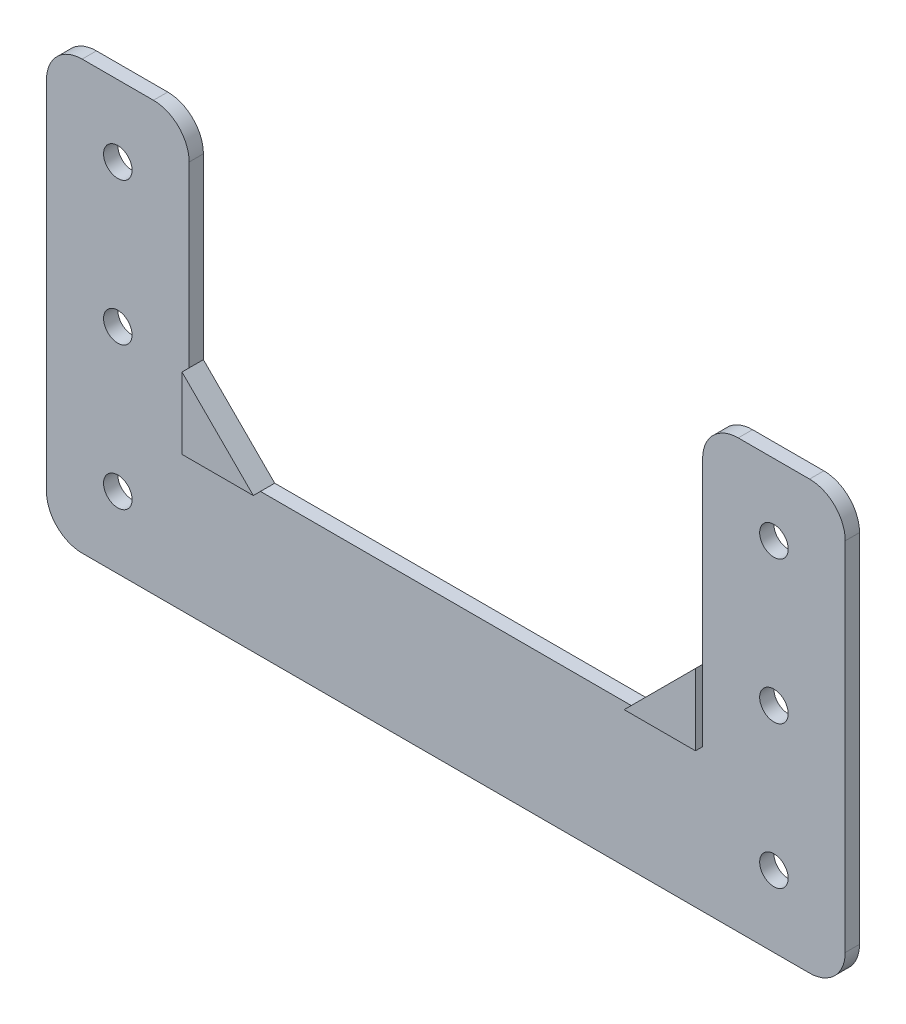
ISO-10303-21;
HEADER;
FILE_DESCRIPTION(('STEP AP214'),'2;1');
FILE_NAME('part.step','',(''),(''),'','','');
FILE_SCHEMA(('AUTOMOTIVE_DESIGN { 1 0 10303 214 1 1 1 1 }'));
ENDSEC;
DATA;
#1=APPLICATION_CONTEXT('core data for automotive mechanical design processes');
#2=APPLICATION_PROTOCOL_DEFINITION('international standard','automotive_design',2000,#1);
#3=PRODUCT_CONTEXT('',#1,'mechanical');
#4=PRODUCT('Part','Part','',(#3));
#5=PRODUCT_RELATED_PRODUCT_CATEGORY('part','',(#4));
#6=PRODUCT_DEFINITION_FORMATION('','',#4);
#7=PRODUCT_DEFINITION_CONTEXT('part definition',#1,'design');
#8=PRODUCT_DEFINITION('design','',#6,#7);
#9=PRODUCT_DEFINITION_SHAPE('','',#8);
#10=(LENGTH_UNIT() NAMED_UNIT(*) SI_UNIT(.MILLI.,.METRE.));
#11=(NAMED_UNIT(*) PLANE_ANGLE_UNIT() SI_UNIT($,.RADIAN.));
#12=(NAMED_UNIT(*) SI_UNIT($,.STERADIAN.) SOLID_ANGLE_UNIT());
#13=UNCERTAINTY_MEASURE_WITH_UNIT(LENGTH_MEASURE(1.E-05),#10,'distance_accuracy_value','');
#14=(GEOMETRIC_REPRESENTATION_CONTEXT(3) GLOBAL_UNCERTAINTY_ASSIGNED_CONTEXT((#13)) GLOBAL_UNIT_ASSIGNED_CONTEXT((#10,
#11,#12)) REPRESENTATION_CONTEXT('',''));
#15=CARTESIAN_POINT('',(0.,0.,0.));
#16=DIRECTION('',(0.,0.,1.));
#17=DIRECTION('',(1.,0.,0.));
#18=AXIS2_PLACEMENT_3D('',#15,#16,#17);
#19=CARTESIAN_POINT('',(0.,-9.99999999999999,3.));
#20=DIRECTION('',(0.,1.,0.));
#21=DIRECTION('',(-1.,0.,0.));
#22=AXIS2_PLACEMENT_3D('',#19,#20,#21);
#23=PLANE('',#22);
#24=DIRECTION('',(0.,0.,1.));
#25=VECTOR('',#24,1.);
#26=CARTESIAN_POINT('',(-26.,-10.,3.));
#27=LINE('',#26,#25);
#28=CARTESIAN_POINT('',(-26.,-10.,0.));
#29=VERTEX_POINT('',#28);
#30=CARTESIAN_POINT('',(-26.,-10.,2.));
#31=VERTEX_POINT('',#30);
#32=EDGE_CURVE('E236',#29,#31,#27,.T.);
#33=ORIENTED_EDGE('',*,*,#32,.T.);
#34=DIRECTION('',(-1.,0.,0.));
#35=VECTOR('',#34,1.);
#36=CARTESIAN_POINT('',(25.9999999999999,-9.99999999999999,2.));
#37=LINE('',#36,#35);
#38=CARTESIAN_POINT('',(25.9999999999999,-9.99999999999999,2.));
#39=VERTEX_POINT('',#38);
#40=EDGE_CURVE('E59',#39,#31,#37,.T.);
#41=ORIENTED_EDGE('',*,*,#40,.F.);
#42=DIRECTION('',(0.,0.,-1.));
#43=VECTOR('',#42,1.);
#44=CARTESIAN_POINT('',(25.9999999999999,-9.99999999999999,3.));
#45=LINE('',#44,#43);
#46=CARTESIAN_POINT('',(25.9999999999999,-9.99999999999999,0.));
#47=VERTEX_POINT('',#46);
#48=EDGE_CURVE('E239',#39,#47,#45,.T.);
#49=ORIENTED_EDGE('',*,*,#48,.T.);
#50=DIRECTION('',(1.,0.,0.));
#51=VECTOR('',#50,1.);
#52=CARTESIAN_POINT('',(0.,-9.99999999999999,0.));
#53=LINE('',#52,#51);
#54=EDGE_CURVE('E258',#29,#47,#53,.T.);
#55=ORIENTED_EDGE('',*,*,#54,.F.);
#56=EDGE_LOOP('',(#33,#41,#49,#55));
#57=FACE_BOUND('',#56,.T.);
#58=ADVANCED_FACE('F43',(#57),#23,.T.);
#59=CARTESIAN_POINT('',(-36.,0.,3.));
#60=DIRECTION('',(1.,0.,0.));
#61=DIRECTION('',(0.,1.,0.));
#62=AXIS2_PLACEMENT_3D('',#59,#60,#61);
#63=PLANE('',#62);
#64=DIRECTION('',(0.,0.,-1.));
#65=VECTOR('',#64,1.);
#66=CARTESIAN_POINT('',(-36.,25.,3.));
#67=LINE('',#66,#65);
#68=CARTESIAN_POINT('',(-36.,25.,0.));
#69=VERTEX_POINT('',#68);
#70=CARTESIAN_POINT('',(-36.,25.,2.));
#71=VERTEX_POINT('',#70);
#72=EDGE_CURVE('E232',#69,#71,#67,.F.);
#73=ORIENTED_EDGE('',*,*,#72,.T.);
#74=DIRECTION('',(0.,1.,0.));
#75=VECTOR('',#74,1.);
#76=CARTESIAN_POINT('',(-36.,0.,2.));
#77=LINE('',#76,#75);
#78=CARTESIAN_POINT('',(-36.,0.,2.));
#79=VERTEX_POINT('',#78);
#80=EDGE_CURVE('E387',#79,#71,#77,.T.);
#81=ORIENTED_EDGE('',*,*,#80,.F.);
#82=DIRECTION('',(0.,0.,-1.));
#83=VECTOR('',#82,1.);
#84=CARTESIAN_POINT('',(-36.,0.,0.));
#85=LINE('',#84,#83);
#86=CARTESIAN_POINT('',(-36.,0.,0.));
#87=VERTEX_POINT('',#86);
#88=EDGE_CURVE('E67',#79,#87,#85,.T.);
#89=ORIENTED_EDGE('',*,*,#88,.T.);
#90=DIRECTION('',(0.,-1.,0.));
#91=VECTOR('',#90,1.);
#92=CARTESIAN_POINT('',(-36.,0.,0.));
#93=LINE('',#92,#91);
#94=EDGE_CURVE('E259',#69,#87,#93,.T.);
#95=ORIENTED_EDGE('',*,*,#94,.F.);
#96=EDGE_LOOP('',(#73,#81,#89,#95));
#97=FACE_BOUND('',#96,.T.);
#98=ADVANCED_FACE('F417',(#97),#63,.T.);
#99=CARTESIAN_POINT('',(0.,30.,3.));
#100=DIRECTION('',(0.,1.,0.));
#101=DIRECTION('',(-1.,0.,0.));
#102=AXIS2_PLACEMENT_3D('',#99,#100,#101);
#103=PLANE('',#102);
#104=DIRECTION('',(0.,0.,-1.));
#105=VECTOR('',#104,1.);
#106=CARTESIAN_POINT('',(-51.,30.,3.));
#107=LINE('',#106,#105);
#108=CARTESIAN_POINT('',(-51.,30.,0.));
#109=VERTEX_POINT('',#108);
#110=CARTESIAN_POINT('',(-51.,30.,2.));
#111=VERTEX_POINT('',#110);
#112=EDGE_CURVE('E228',#109,#111,#107,.F.);
#113=ORIENTED_EDGE('',*,*,#112,.T.);
#114=DIRECTION('',(-1.,0.,0.));
#115=VECTOR('',#114,1.);
#116=CARTESIAN_POINT('',(-41.,30.,2.));
#117=LINE('',#116,#115);
#118=CARTESIAN_POINT('',(-41.,30.,2.));
#119=VERTEX_POINT('',#118);
#120=EDGE_CURVE('E189',#119,#111,#117,.T.);
#121=ORIENTED_EDGE('',*,*,#120,.F.);
#122=DIRECTION('',(0.,0.,-1.));
#123=VECTOR('',#122,1.);
#124=CARTESIAN_POINT('',(-41.,30.,3.));
#125=LINE('',#124,#123);
#126=CARTESIAN_POINT('',(-41.,30.,0.));
#127=VERTEX_POINT('',#126);
#128=EDGE_CURVE('E230',#119,#127,#125,.T.);
#129=ORIENTED_EDGE('',*,*,#128,.T.);
#130=DIRECTION('',(1.,0.,0.));
#131=VECTOR('',#130,1.);
#132=CARTESIAN_POINT('',(0.,30.,0.));
#133=LINE('',#132,#131);
#134=EDGE_CURVE('E312',#109,#127,#133,.T.);
#135=ORIENTED_EDGE('',*,*,#134,.F.);
#136=EDGE_LOOP('',(#113,#121,#129,#135));
#137=FACE_BOUND('',#136,.T.);
#138=ADVANCED_FACE('F397',(#137),#103,.T.);
#139=CARTESIAN_POINT('',(-56.,0.,3.));
#140=DIRECTION('',(-1.,0.,0.));
#141=DIRECTION('',(0.,-1.,0.));
#142=AXIS2_PLACEMENT_3D('',#139,#140,#141);
#143=PLANE('',#142);
#144=DIRECTION('',(0.,0.,-1.));
#145=VECTOR('',#144,1.);
#146=CARTESIAN_POINT('',(-56.,-25.,3.));
#147=LINE('',#146,#145);
#148=CARTESIAN_POINT('',(-56.,-25.,0.));
#149=VERTEX_POINT('',#148);
#150=CARTESIAN_POINT('',(-56.,-25.,2.));
#151=VERTEX_POINT('',#150);
#152=EDGE_CURVE('E203',#149,#151,#147,.F.);
#153=ORIENTED_EDGE('',*,*,#152,.T.);
#154=DIRECTION('',(0.,-1.,0.));
#155=VECTOR('',#154,1.);
#156=CARTESIAN_POINT('',(-56.,25.,2.));
#157=LINE('',#156,#155);
#158=CARTESIAN_POINT('',(-56.,25.,2.));
#159=VERTEX_POINT('',#158);
#160=EDGE_CURVE('E186',#159,#151,#157,.T.);
#161=ORIENTED_EDGE('',*,*,#160,.F.);
#162=DIRECTION('',(0.,0.,-1.));
#163=VECTOR('',#162,1.);
#164=CARTESIAN_POINT('',(-56.,25.,3.));
#165=LINE('',#164,#163);
#166=CARTESIAN_POINT('',(-56.,25.,0.));
#167=VERTEX_POINT('',#166);
#168=EDGE_CURVE('E200',#159,#167,#165,.T.);
#169=ORIENTED_EDGE('',*,*,#168,.T.);
#170=DIRECTION('',(0.,1.,0.));
#171=VECTOR('',#170,1.);
#172=CARTESIAN_POINT('',(-56.,0.,0.));
#173=LINE('',#172,#171);
#174=EDGE_CURVE('E315',#149,#167,#173,.T.);
#175=ORIENTED_EDGE('',*,*,#174,.F.);
#176=EDGE_LOOP('',(#153,#161,#169,#175));
#177=FACE_BOUND('',#176,.T.);
#178=ADVANCED_FACE('F198',(#177),#143,.T.);
#179=CARTESIAN_POINT('',(0.,-30.,3.));
#180=DIRECTION('',(0.,1.,0.));
#181=DIRECTION('',(-1.,0.,0.));
#182=AXIS2_PLACEMENT_3D('',#179,#180,#181);
#183=PLANE('',#182);
#184=DIRECTION('',(1.,0.,0.));
#185=VECTOR('',#184,1.);
#186=CARTESIAN_POINT('',(-51.,-30.,2.));
#187=LINE('',#186,#185);
#188=CARTESIAN_POINT('',(-51.,-30.,2.));
#189=VERTEX_POINT('',#188);
#190=CARTESIAN_POINT('',(51.,-30.,2.));
#191=VERTEX_POINT('',#190);
#192=EDGE_CURVE('E369',#189,#191,#187,.T.);
#193=ORIENTED_EDGE('',*,*,#192,.F.);
#194=DIRECTION('',(0.,0.,-1.));
#195=VECTOR('',#194,1.);
#196=CARTESIAN_POINT('',(-51.,-30.,0.));
#197=LINE('',#196,#195);
#198=CARTESIAN_POINT('',(-51.,-30.,0.));
#199=VERTEX_POINT('',#198);
#200=EDGE_CURVE('E346',#189,#199,#197,.T.);
#201=ORIENTED_EDGE('',*,*,#200,.T.);
#202=DIRECTION('',(1.,0.,0.));
#203=VECTOR('',#202,1.);
#204=CARTESIAN_POINT('',(0.,-30.,0.));
#205=LINE('',#204,#203);
#206=CARTESIAN_POINT('',(51.,-30.,0.));
#207=VERTEX_POINT('',#206);
#208=EDGE_CURVE('E318',#199,#207,#205,.T.);
#209=ORIENTED_EDGE('',*,*,#208,.T.);
#210=DIRECTION('',(0.,0.,-1.));
#211=VECTOR('',#210,1.);
#212=CARTESIAN_POINT('',(51.,-30.,3.));
#213=LINE('',#212,#211);
#214=EDGE_CURVE('E327',#207,#191,#213,.F.);
#215=ORIENTED_EDGE('',*,*,#214,.T.);
#216=EDGE_LOOP('',(#193,#201,#209,#215));
#217=FACE_BOUND('',#216,.T.);
#218=ADVANCED_FACE('F361',(#217),#183,.F.);
#219=CARTESIAN_POINT('',(56.,0.,3.));
#220=DIRECTION('',(-1.,0.,0.));
#221=DIRECTION('',(0.,-1.,0.));
#222=AXIS2_PLACEMENT_3D('',#219,#220,#221);
#223=PLANE('',#222);
#224=DIRECTION('',(0.,1.,0.));
#225=VECTOR('',#224,1.);
#226=CARTESIAN_POINT('',(56.,-25.,2.));
#227=LINE('',#226,#225);
#228=CARTESIAN_POINT('',(56.,-25.,2.));
#229=VERTEX_POINT('',#228);
#230=CARTESIAN_POINT('',(56.,25.,2.));
#231=VERTEX_POINT('',#230);
#232=EDGE_CURVE('E368',#229,#231,#227,.T.);
#233=ORIENTED_EDGE('',*,*,#232,.F.);
#234=DIRECTION('',(0.,0.,-1.));
#235=VECTOR('',#234,1.);
#236=CARTESIAN_POINT('',(56.,-25.,3.));
#237=LINE('',#236,#235);
#238=CARTESIAN_POINT('',(56.,-25.,0.));
#239=VERTEX_POINT('',#238);
#240=EDGE_CURVE('E219',#229,#239,#237,.T.);
#241=ORIENTED_EDGE('',*,*,#240,.T.);
#242=DIRECTION('',(0.,1.,0.));
#243=VECTOR('',#242,1.);
#244=CARTESIAN_POINT('',(56.,0.,0.));
#245=LINE('',#244,#243);
#246=CARTESIAN_POINT('',(56.,25.,0.));
#247=VERTEX_POINT('',#246);
#248=EDGE_CURVE('E321',#239,#247,#245,.T.);
#249=ORIENTED_EDGE('',*,*,#248,.T.);
#250=DIRECTION('',(0.,0.,-1.));
#251=VECTOR('',#250,1.);
#252=CARTESIAN_POINT('',(56.,25.,3.));
#253=LINE('',#252,#251);
#254=EDGE_CURVE('E211',#247,#231,#253,.F.);
#255=ORIENTED_EDGE('',*,*,#254,.T.);
#256=EDGE_LOOP('',(#233,#241,#249,#255));
#257=FACE_BOUND('',#256,.T.);
#258=ADVANCED_FACE('F428',(#257),#223,.F.);
#259=DIRECTION('',(0.,0.,-1.));
#260=VECTOR('',#259,1.);
#261=CARTESIAN_POINT('',(41.,30.,3.));
#262=LINE('',#261,#260);
#263=CARTESIAN_POINT('',(41.,30.,0.));
#264=VERTEX_POINT('',#263);
#265=CARTESIAN_POINT('',(41.,30.,2.));
#266=VERTEX_POINT('',#265);
#267=EDGE_CURVE('E221',#264,#266,#262,.F.);
#268=ORIENTED_EDGE('',*,*,#267,.T.);
#269=DIRECTION('',(-1.,0.,0.));
#270=VECTOR('',#269,1.);
#271=CARTESIAN_POINT('',(51.,30.,2.));
#272=LINE('',#271,#270);
#273=CARTESIAN_POINT('',(51.,30.,2.));
#274=VERTEX_POINT('',#273);
#275=EDGE_CURVE('E377',#274,#266,#272,.T.);
#276=ORIENTED_EDGE('',*,*,#275,.F.);
#277=DIRECTION('',(0.,0.,-1.));
#278=VECTOR('',#277,1.);
#279=CARTESIAN_POINT('',(51.,30.,0.));
#280=LINE('',#279,#278);
#281=CARTESIAN_POINT('',(51.,30.,0.));
#282=VERTEX_POINT('',#281);
#283=EDGE_CURVE('E224',#274,#282,#280,.T.);
#284=ORIENTED_EDGE('',*,*,#283,.T.);
#285=EDGE_CURVE('E316',#264,#282,#133,.T.);
#286=ORIENTED_EDGE('',*,*,#285,.F.);
#287=EDGE_LOOP('',(#268,#276,#284,#286));
#288=FACE_BOUND('',#287,.T.);
#289=ADVANCED_FACE('F431',(#288),#103,.T.);
#290=CARTESIAN_POINT('',(36.,0.,3.));
#291=DIRECTION('',(1.,0.,0.));
#292=DIRECTION('',(0.,0.,-1.));
#293=AXIS2_PLACEMENT_3D('',#290,#291,#292);
#294=PLANE('',#293);
#295=DIRECTION('',(0.,-1.,0.));
#296=VECTOR('',#295,1.);
#297=CARTESIAN_POINT('',(36.,25.,2.));
#298=LINE('',#297,#296);
#299=CARTESIAN_POINT('',(36.,25.,2.));
#300=VERTEX_POINT('',#299);
#301=CARTESIAN_POINT('',(36.,0.,2.));
#302=VERTEX_POINT('',#301);
#303=EDGE_CURVE('E382',#300,#302,#298,.T.);
#304=ORIENTED_EDGE('',*,*,#303,.F.);
#305=DIRECTION('',(0.,0.,-1.));
#306=VECTOR('',#305,1.);
#307=CARTESIAN_POINT('',(36.,25.,0.));
#308=LINE('',#307,#306);
#309=CARTESIAN_POINT('',(36.,25.,0.));
#310=VERTEX_POINT('',#309);
#311=EDGE_CURVE('E226',#300,#310,#308,.T.);
#312=ORIENTED_EDGE('',*,*,#311,.T.);
#313=DIRECTION('',(0.,-1.,0.));
#314=VECTOR('',#313,1.);
#315=CARTESIAN_POINT('',(36.,0.,0.));
#316=LINE('',#315,#314);
#317=CARTESIAN_POINT('',(36.,0.,0.));
#318=VERTEX_POINT('',#317);
#319=EDGE_CURVE('E324',#310,#318,#316,.T.);
#320=ORIENTED_EDGE('',*,*,#319,.T.);
#321=DIRECTION('',(0.,0.,1.));
#322=VECTOR('',#321,1.);
#323=CARTESIAN_POINT('',(36.,0.,3.));
#324=LINE('',#323,#322);
#325=EDGE_CURVE('E243',#318,#302,#324,.T.);
#326=ORIENTED_EDGE('',*,*,#325,.T.);
#327=EDGE_LOOP('',(#304,#312,#320,#326));
#328=FACE_BOUND('',#327,.T.);
#329=ADVANCED_FACE('F435',(#328),#294,.F.);
#330=CARTESIAN_POINT('',(0.,0.,3.));
#331=DIRECTION('',(0.,0.,1.));
#332=DIRECTION('',(1.,0.,0.));
#333=AXIS2_PLACEMENT_3D('',#330,#331,#332);
#334=PLANE('',#333);
#335=DIRECTION('',(0.,1.,0.));
#336=VECTOR('',#335,1.);
#337=CARTESIAN_POINT('',(-36.,0.,3.));
#338=LINE('',#337,#336);
#339=CARTESIAN_POINT('',(-36.,-10.,3.));
#340=VERTEX_POINT('',#339);
#341=CARTESIAN_POINT('',(-36.,0.,3.));
#342=VERTEX_POINT('',#341);
#343=EDGE_CURVE('E194',#340,#342,#338,.T.);
#344=ORIENTED_EDGE('',*,*,#343,.F.);
#345=DIRECTION('',(-1.,0.,0.));
#346=VECTOR('',#345,1.);
#347=CARTESIAN_POINT('',(-36.,-10.,3.));
#348=LINE('',#347,#346);
#349=CARTESIAN_POINT('',(-26.,-10.,3.));
#350=VERTEX_POINT('',#349);
#351=EDGE_CURVE('E274',#350,#340,#348,.T.);
#352=ORIENTED_EDGE('',*,*,#351,.F.);
#353=DIRECTION('',(0.707106781186544,-0.707106781186551,0.));
#354=VECTOR('',#353,1.);
#355=CARTESIAN_POINT('',(-36.,0.,3.));
#356=LINE('',#355,#354);
#357=EDGE_CURVE('E11',#350,#342,#356,.F.);
#358=ORIENTED_EDGE('',*,*,#357,.T.);
#359=EDGE_LOOP('',(#344,#352,#358));
#360=FACE_BOUND('',#359,.T.);
#361=ADVANCED_FACE('F279',(#360),#334,.T.);
#362=CARTESIAN_POINT('',(-46.,-20.,-7.));
#363=DIRECTION('',(0.,0.,1.));
#364=DIRECTION('',(1.,0.,0.));
#365=AXIS2_PLACEMENT_3D('',#362,#363,#364);
#366=CYLINDRICAL_SURFACE('',#365,2.);
#367=CARTESIAN_POINT('',(-46.,-20.,0.));
#368=DIRECTION('',(0.,0.,1.));
#369=DIRECTION('',(1.,0.,0.));
#370=AXIS2_PLACEMENT_3D('',#367,#368,#369);
#371=CIRCLE('',#370,2.);
#372=CARTESIAN_POINT('',(-44.,-20.,0.));
#373=VERTEX_POINT('',#372);
#374=EDGE_CURVE('E309',#373,#373,#371,.T.);
#375=ORIENTED_EDGE('',*,*,#374,.F.);
#376=EDGE_LOOP('',(#375));
#377=FACE_BOUND('',#376,.T.);
#378=CARTESIAN_POINT('',(-46.,-20.,2.));
#379=DIRECTION('',(0.,0.,1.));
#380=DIRECTION('',(1.,0.,0.));
#381=AXIS2_PLACEMENT_3D('',#378,#379,#380);
#382=CIRCLE('',#381,2.);
#383=CARTESIAN_POINT('',(-44.,-20.,2.));
#384=VERTEX_POINT('',#383);
#385=EDGE_CURVE('E307',#384,#384,#382,.F.);
#386=ORIENTED_EDGE('',*,*,#385,.F.);
#387=EDGE_LOOP('',(#386));
#388=FACE_BOUND('',#387,.T.);
#389=ADVANCED_FACE('F446',(#377,#388),#366,.F.);
#390=CARTESIAN_POINT('',(45.9999999999999,20.,-7.));
#391=DIRECTION('',(0.,0.,1.));
#392=DIRECTION('',(1.,0.,0.));
#393=AXIS2_PLACEMENT_3D('',#390,#391,#392);
#394=CYLINDRICAL_SURFACE('',#393,2.);
#395=CARTESIAN_POINT('',(45.9999999999999,20.,0.));
#396=DIRECTION('',(0.,0.,1.));
#397=DIRECTION('',(1.,0.,0.));
#398=AXIS2_PLACEMENT_3D('',#395,#396,#397);
#399=CIRCLE('',#398,2.);
#400=CARTESIAN_POINT('',(47.9999999999999,20.,0.));
#401=VERTEX_POINT('',#400);
#402=EDGE_CURVE('E330',#401,#401,#399,.T.);
#403=ORIENTED_EDGE('',*,*,#402,.F.);
#404=EDGE_LOOP('',(#403));
#405=FACE_BOUND('',#404,.T.);
#406=CARTESIAN_POINT('',(45.9999999999999,20.,2.));
#407=DIRECTION('',(0.,0.,1.));
#408=DIRECTION('',(1.,0.,0.));
#409=AXIS2_PLACEMENT_3D('',#406,#407,#408);
#410=CIRCLE('',#409,2.);
#411=CARTESIAN_POINT('',(47.9999999999999,20.,2.));
#412=VERTEX_POINT('',#411);
#413=EDGE_CURVE('E304',#412,#412,#410,.F.);
#414=ORIENTED_EDGE('',*,*,#413,.F.);
#415=EDGE_LOOP('',(#414));
#416=FACE_BOUND('',#415,.T.);
#417=ADVANCED_FACE('F449',(#405,#416),#394,.F.);
#418=CARTESIAN_POINT('',(-46.0000000000001,20.,-7.));
#419=DIRECTION('',(0.,0.,1.));
#420=DIRECTION('',(1.,0.,0.));
#421=AXIS2_PLACEMENT_3D('',#418,#419,#420);
#422=CYLINDRICAL_SURFACE('',#421,2.);
#423=CARTESIAN_POINT('',(-46.0000000000001,20.,0.));
#424=DIRECTION('',(0.,0.,1.));
#425=DIRECTION('',(1.,0.,0.));
#426=AXIS2_PLACEMENT_3D('',#423,#424,#425);
#427=CIRCLE('',#426,2.);
#428=CARTESIAN_POINT('',(-44.0000000000001,20.,0.));
#429=VERTEX_POINT('',#428);
#430=EDGE_CURVE('E333',#429,#429,#427,.T.);
#431=ORIENTED_EDGE('',*,*,#430,.F.);
#432=EDGE_LOOP('',(#431));
#433=FACE_BOUND('',#432,.T.);
#434=CARTESIAN_POINT('',(-46.0000000000001,20.,2.));
#435=DIRECTION('',(0.,0.,1.));
#436=DIRECTION('',(1.,0.,0.));
#437=AXIS2_PLACEMENT_3D('',#434,#435,#436);
#438=CIRCLE('',#437,2.);
#439=CARTESIAN_POINT('',(-44.0000000000001,20.,2.));
#440=VERTEX_POINT('',#439);
#441=EDGE_CURVE('E301',#440,#440,#438,.F.);
#442=ORIENTED_EDGE('',*,*,#441,.F.);
#443=EDGE_LOOP('',(#442));
#444=FACE_BOUND('',#443,.T.);
#445=ADVANCED_FACE('F451',(#433,#444),#422,.F.);
#446=CARTESIAN_POINT('',(-46.0000000000001,0.,-7.));
#447=DIRECTION('',(0.,0.,1.));
#448=DIRECTION('',(1.,0.,0.));
#449=AXIS2_PLACEMENT_3D('',#446,#447,#448);
#450=CYLINDRICAL_SURFACE('',#449,2.);
#451=CARTESIAN_POINT('',(-46.0000000000001,0.,0.));
#452=DIRECTION('',(0.,0.,1.));
#453=DIRECTION('',(1.,0.,0.));
#454=AXIS2_PLACEMENT_3D('',#451,#452,#453);
#455=CIRCLE('',#454,2.);
#456=CARTESIAN_POINT('',(-44.0000000000001,0.,0.));
#457=VERTEX_POINT('',#456);
#458=EDGE_CURVE('E336',#457,#457,#455,.T.);
#459=ORIENTED_EDGE('',*,*,#458,.F.);
#460=EDGE_LOOP('',(#459));
#461=FACE_BOUND('',#460,.T.);
#462=CARTESIAN_POINT('',(-46.0000000000001,0.,2.));
#463=DIRECTION('',(0.,0.,1.));
#464=DIRECTION('',(1.,0.,0.));
#465=AXIS2_PLACEMENT_3D('',#462,#463,#464);
#466=CIRCLE('',#465,2.);
#467=CARTESIAN_POINT('',(-44.0000000000001,0.,2.));
#468=VERTEX_POINT('',#467);
#469=EDGE_CURVE('E298',#468,#468,#466,.F.);
#470=ORIENTED_EDGE('',*,*,#469,.F.);
#471=EDGE_LOOP('',(#470));
#472=FACE_BOUND('',#471,.T.);
#473=ADVANCED_FACE('F454',(#461,#472),#450,.F.);
#474=CARTESIAN_POINT('',(46.,0.,-7.));
#475=DIRECTION('',(0.,0.,1.));
#476=DIRECTION('',(1.,0.,0.));
#477=AXIS2_PLACEMENT_3D('',#474,#475,#476);
#478=CYLINDRICAL_SURFACE('',#477,2.);
#479=CARTESIAN_POINT('',(46.,0.,0.));
#480=DIRECTION('',(0.,0.,1.));
#481=DIRECTION('',(1.,0.,0.));
#482=AXIS2_PLACEMENT_3D('',#479,#480,#481);
#483=CIRCLE('',#482,2.);
#484=CARTESIAN_POINT('',(48.,0.,0.));
#485=VERTEX_POINT('',#484);
#486=EDGE_CURVE('E339',#485,#485,#483,.T.);
#487=ORIENTED_EDGE('',*,*,#486,.F.);
#488=EDGE_LOOP('',(#487));
#489=FACE_BOUND('',#488,.T.);
#490=CARTESIAN_POINT('',(46.,0.,2.));
#491=DIRECTION('',(0.,0.,1.));
#492=DIRECTION('',(1.,0.,0.));
#493=AXIS2_PLACEMENT_3D('',#490,#491,#492);
#494=CIRCLE('',#493,2.);
#495=CARTESIAN_POINT('',(48.,0.,2.));
#496=VERTEX_POINT('',#495);
#497=EDGE_CURVE('E295',#496,#496,#494,.F.);
#498=ORIENTED_EDGE('',*,*,#497,.F.);
#499=EDGE_LOOP('',(#498));
#500=FACE_BOUND('',#499,.T.);
#501=ADVANCED_FACE('F412',(#489,#500),#478,.F.);
#502=CARTESIAN_POINT('',(46.,-20.,-7.));
#503=DIRECTION('',(0.,0.,1.));
#504=DIRECTION('',(1.,0.,0.));
#505=AXIS2_PLACEMENT_3D('',#502,#503,#504);
#506=CYLINDRICAL_SURFACE('',#505,2.);
#507=CARTESIAN_POINT('',(46.,-20.,0.));
#508=DIRECTION('',(0.,0.,1.));
#509=DIRECTION('',(1.,0.,0.));
#510=AXIS2_PLACEMENT_3D('',#507,#508,#509);
#511=CIRCLE('',#510,2.);
#512=CARTESIAN_POINT('',(48.,-20.,0.));
#513=VERTEX_POINT('',#512);
#514=EDGE_CURVE('E265',#513,#513,#511,.T.);
#515=ORIENTED_EDGE('',*,*,#514,.F.);
#516=EDGE_LOOP('',(#515));
#517=FACE_BOUND('',#516,.T.);
#518=CARTESIAN_POINT('',(46.,-20.,2.));
#519=DIRECTION('',(0.,0.,1.));
#520=DIRECTION('',(1.,0.,0.));
#521=AXIS2_PLACEMENT_3D('',#518,#519,#520);
#522=CIRCLE('',#521,2.);
#523=CARTESIAN_POINT('',(48.,-20.,2.));
#524=VERTEX_POINT('',#523);
#525=EDGE_CURVE('E289',#524,#524,#522,.F.);
#526=ORIENTED_EDGE('',*,*,#525,.F.);
#527=EDGE_LOOP('',(#526));
#528=FACE_BOUND('',#527,.T.);
#529=ADVANCED_FACE('F404',(#517,#528),#506,.F.);
#530=CARTESIAN_POINT('',(-51.,-25.,3.));
#531=DIRECTION('',(0.,0.,1.));
#532=DIRECTION('',(1.,0.,0.));
#533=AXIS2_PLACEMENT_3D('',#530,#531,#532);
#534=CYLINDRICAL_SURFACE('',#533,5.);
#535=ORIENTED_EDGE('',*,*,#200,.F.);
#536=CARTESIAN_POINT('',(-51.,-25.,2.));
#537=DIRECTION('',(0.,0.,1.));
#538=DIRECTION('',(1.,0.,0.));
#539=AXIS2_PLACEMENT_3D('',#536,#537,#538);
#540=CIRCLE('',#539,5.);
#541=EDGE_CURVE('E204',#151,#189,#540,.T.);
#542=ORIENTED_EDGE('',*,*,#541,.F.);
#543=ORIENTED_EDGE('',*,*,#152,.F.);
#544=CARTESIAN_POINT('',(-51.,-25.,0.));
#545=DIRECTION('',(0.,0.,1.));
#546=DIRECTION('',(1.,0.,0.));
#547=AXIS2_PLACEMENT_3D('',#544,#545,#546);
#548=CIRCLE('',#547,5.);
#549=EDGE_CURVE('E209',#199,#149,#548,.F.);
#550=ORIENTED_EDGE('',*,*,#549,.F.);
#551=EDGE_LOOP('',(#535,#542,#543,#550));
#552=FACE_BOUND('',#551,.T.);
#553=ADVANCED_FACE('F402',(#552),#534,.T.);
#554=CARTESIAN_POINT('',(51.,-25.,3.));
#555=DIRECTION('',(0.,0.,-1.));
#556=DIRECTION('',(-1.,0.,0.));
#557=AXIS2_PLACEMENT_3D('',#554,#555,#556);
#558=CYLINDRICAL_SURFACE('',#557,5.);
#559=ORIENTED_EDGE('',*,*,#240,.F.);
#560=CARTESIAN_POINT('',(51.,-25.,2.));
#561=DIRECTION('',(0.,0.,1.));
#562=DIRECTION('',(1.,0.,0.));
#563=AXIS2_PLACEMENT_3D('',#560,#561,#562);
#564=CIRCLE('',#563,5.);
#565=EDGE_CURVE('E366',#191,#229,#564,.T.);
#566=ORIENTED_EDGE('',*,*,#565,.F.);
#567=ORIENTED_EDGE('',*,*,#214,.F.);
#568=CARTESIAN_POINT('',(51.,-25.,0.));
#569=DIRECTION('',(0.,0.,1.));
#570=DIRECTION('',(1.,0.,0.));
#571=AXIS2_PLACEMENT_3D('',#568,#569,#570);
#572=CIRCLE('',#571,5.);
#573=EDGE_CURVE('E213',#239,#207,#572,.F.);
#574=ORIENTED_EDGE('',*,*,#573,.F.);
#575=EDGE_LOOP('',(#559,#566,#567,#574));
#576=FACE_BOUND('',#575,.T.);
#577=ADVANCED_FACE('F365',(#576),#558,.T.);
#578=CARTESIAN_POINT('',(51.,25.,3.));
#579=DIRECTION('',(0.,0.,1.));
#580=DIRECTION('',(1.,0.,0.));
#581=AXIS2_PLACEMENT_3D('',#578,#579,#580);
#582=CYLINDRICAL_SURFACE('',#581,5.);
#583=ORIENTED_EDGE('',*,*,#283,.F.);
#584=CARTESIAN_POINT('',(51.,25.,2.));
#585=DIRECTION('',(0.,0.,1.));
#586=DIRECTION('',(1.,0.,0.));
#587=AXIS2_PLACEMENT_3D('',#584,#585,#586);
#588=CIRCLE('',#587,5.);
#589=EDGE_CURVE('E371',#231,#274,#588,.T.);
#590=ORIENTED_EDGE('',*,*,#589,.F.);
#591=ORIENTED_EDGE('',*,*,#254,.F.);
#592=CARTESIAN_POINT('',(51.,25.,0.));
#593=DIRECTION('',(0.,0.,1.));
#594=DIRECTION('',(1.,0.,0.));
#595=AXIS2_PLACEMENT_3D('',#592,#593,#594);
#596=CIRCLE('',#595,5.);
#597=EDGE_CURVE('E353',#282,#247,#596,.F.);
#598=ORIENTED_EDGE('',*,*,#597,.F.);
#599=EDGE_LOOP('',(#583,#590,#591,#598));
#600=FACE_BOUND('',#599,.T.);
#601=ADVANCED_FACE('F410',(#600),#582,.T.);
#602=CARTESIAN_POINT('',(41.,25.,3.));
#603=DIRECTION('',(0.,0.,1.));
#604=DIRECTION('',(1.,0.,0.));
#605=AXIS2_PLACEMENT_3D('',#602,#603,#604);
#606=CYLINDRICAL_SURFACE('',#605,5.);
#607=ORIENTED_EDGE('',*,*,#311,.F.);
#608=CARTESIAN_POINT('',(41.,25.,2.));
#609=DIRECTION('',(0.,0.,1.));
#610=DIRECTION('',(1.,0.,0.));
#611=AXIS2_PLACEMENT_3D('',#608,#609,#610);
#612=CIRCLE('',#611,5.);
#613=EDGE_CURVE('E379',#266,#300,#612,.T.);
#614=ORIENTED_EDGE('',*,*,#613,.F.);
#615=ORIENTED_EDGE('',*,*,#267,.F.);
#616=CARTESIAN_POINT('',(41.,25.,0.));
#617=DIRECTION('',(0.,0.,1.));
#618=DIRECTION('',(1.,0.,0.));
#619=AXIS2_PLACEMENT_3D('',#616,#617,#618);
#620=CIRCLE('',#619,5.);
#621=EDGE_CURVE('E351',#310,#264,#620,.F.);
#622=ORIENTED_EDGE('',*,*,#621,.F.);
#623=EDGE_LOOP('',(#607,#614,#615,#622));
#624=FACE_BOUND('',#623,.T.);
#625=ADVANCED_FACE('F532',(#624),#606,.T.);
#626=CARTESIAN_POINT('',(-41.,25.,3.));
#627=DIRECTION('',(0.,0.,-1.));
#628=DIRECTION('',(-1.,0.,0.));
#629=AXIS2_PLACEMENT_3D('',#626,#627,#628);
#630=CYLINDRICAL_SURFACE('',#629,5.);
#631=ORIENTED_EDGE('',*,*,#128,.F.);
#632=CARTESIAN_POINT('',(-41.,25.,2.));
#633=DIRECTION('',(0.,0.,1.));
#634=DIRECTION('',(1.,0.,0.));
#635=AXIS2_PLACEMENT_3D('',#632,#633,#634);
#636=CIRCLE('',#635,5.);
#637=EDGE_CURVE('E391',#71,#119,#636,.T.);
#638=ORIENTED_EDGE('',*,*,#637,.F.);
#639=ORIENTED_EDGE('',*,*,#72,.F.);
#640=CARTESIAN_POINT('',(-41.,25.,0.));
#641=DIRECTION('',(0.,0.,1.));
#642=DIRECTION('',(1.,0.,0.));
#643=AXIS2_PLACEMENT_3D('',#640,#641,#642);
#644=CIRCLE('',#643,5.);
#645=EDGE_CURVE('E349',#127,#69,#644,.F.);
#646=ORIENTED_EDGE('',*,*,#645,.F.);
#647=EDGE_LOOP('',(#631,#638,#639,#646));
#648=FACE_BOUND('',#647,.T.);
#649=ADVANCED_FACE('F400',(#648),#630,.T.);
#650=CARTESIAN_POINT('',(-51.,25.,3.));
#651=DIRECTION('',(0.,0.,-1.));
#652=DIRECTION('',(-1.,0.,0.));
#653=AXIS2_PLACEMENT_3D('',#650,#651,#652);
#654=CYLINDRICAL_SURFACE('',#653,5.);
#655=ORIENTED_EDGE('',*,*,#168,.F.);
#656=CARTESIAN_POINT('',(-51.,25.,2.));
#657=DIRECTION('',(0.,0.,1.));
#658=DIRECTION('',(1.,0.,0.));
#659=AXIS2_PLACEMENT_3D('',#656,#657,#658);
#660=CIRCLE('',#659,5.);
#661=EDGE_CURVE('E182',#111,#159,#660,.T.);
#662=ORIENTED_EDGE('',*,*,#661,.F.);
#663=ORIENTED_EDGE('',*,*,#112,.F.);
#664=CARTESIAN_POINT('',(-51.,25.,0.));
#665=DIRECTION('',(0.,0.,1.));
#666=DIRECTION('',(1.,0.,0.));
#667=AXIS2_PLACEMENT_3D('',#664,#665,#666);
#668=CIRCLE('',#667,5.);
#669=EDGE_CURVE('E207',#167,#109,#668,.F.);
#670=ORIENTED_EDGE('',*,*,#669,.F.);
#671=EDGE_LOOP('',(#655,#662,#663,#670));
#672=FACE_BOUND('',#671,.T.);
#673=ADVANCED_FACE('F206',(#672),#654,.T.);
#674=CARTESIAN_POINT('',(36.,-9.99999999999999,3.));
#675=VERTEX_POINT('',#674);
#676=CARTESIAN_POINT('',(25.9999999999999,-10.,3.));
#677=VERTEX_POINT('',#676);
#678=EDGE_CURVE('E280',#675,#677,#348,.T.);
#679=ORIENTED_EDGE('',*,*,#678,.F.);
#680=DIRECTION('',(0.,-1.,0.));
#681=VECTOR('',#680,1.);
#682=CARTESIAN_POINT('',(36.,-9.99999999999999,3.));
#683=LINE('',#682,#681);
#684=CARTESIAN_POINT('',(36.,0.,3.));
#685=VERTEX_POINT('',#684);
#686=EDGE_CURVE('E281',#685,#675,#683,.T.);
#687=ORIENTED_EDGE('',*,*,#686,.F.);
#688=DIRECTION('',(-0.707106781186551,-0.707106781186544,0.));
#689=VECTOR('',#688,1.);
#690=CARTESIAN_POINT('',(25.9999999999999,-9.99999999999999,3.));
#691=LINE('',#690,#689);
#692=EDGE_CURVE('E250',#685,#677,#691,.T.);
#693=ORIENTED_EDGE('',*,*,#692,.T.);
#694=EDGE_LOOP('',(#679,#687,#693));
#695=FACE_BOUND('',#694,.T.);
#696=ADVANCED_FACE('F441',(#695),#334,.T.);
#697=CARTESIAN_POINT('',(0.,0.,0.));
#698=DIRECTION('',(0.,0.,1.));
#699=DIRECTION('',(1.,0.,0.));
#700=AXIS2_PLACEMENT_3D('',#697,#698,#699);
#701=PLANE('',#700);
#702=ORIENTED_EDGE('',*,*,#514,.T.);
#703=EDGE_LOOP('',(#702));
#704=FACE_BOUND('',#703,.T.);
#705=ORIENTED_EDGE('',*,*,#486,.T.);
#706=EDGE_LOOP('',(#705));
#707=FACE_BOUND('',#706,.T.);
#708=ORIENTED_EDGE('',*,*,#458,.T.);
#709=EDGE_LOOP('',(#708));
#710=FACE_BOUND('',#709,.T.);
#711=ORIENTED_EDGE('',*,*,#430,.T.);
#712=EDGE_LOOP('',(#711));
#713=FACE_BOUND('',#712,.T.);
#714=ORIENTED_EDGE('',*,*,#402,.T.);
#715=EDGE_LOOP('',(#714));
#716=FACE_BOUND('',#715,.T.);
#717=ORIENTED_EDGE('',*,*,#374,.T.);
#718=EDGE_LOOP('',(#717));
#719=FACE_BOUND('',#718,.T.);
#720=ORIENTED_EDGE('',*,*,#208,.F.);
#721=ORIENTED_EDGE('',*,*,#549,.T.);
#722=ORIENTED_EDGE('',*,*,#174,.T.);
#723=ORIENTED_EDGE('',*,*,#669,.T.);
#724=ORIENTED_EDGE('',*,*,#134,.T.);
#725=ORIENTED_EDGE('',*,*,#645,.T.);
#726=ORIENTED_EDGE('',*,*,#94,.T.);
#727=DIRECTION('',(-0.707106781186544,0.707106781186551,0.));
#728=VECTOR('',#727,1.);
#729=CARTESIAN_POINT('',(-18.0000000000001,-18.,0.));
#730=LINE('',#729,#728);
#731=EDGE_CURVE('E52',#87,#29,#730,.F.);
#732=ORIENTED_EDGE('',*,*,#731,.T.);
#733=ORIENTED_EDGE('',*,*,#54,.T.);
#734=DIRECTION('',(0.707106781186551,0.707106781186544,0.));
#735=VECTOR('',#734,1.);
#736=CARTESIAN_POINT('',(17.9999999999998,-18.,0.));
#737=LINE('',#736,#735);
#738=EDGE_CURVE('E248',#47,#318,#737,.T.);
#739=ORIENTED_EDGE('',*,*,#738,.T.);
#740=ORIENTED_EDGE('',*,*,#319,.F.);
#741=ORIENTED_EDGE('',*,*,#621,.T.);
#742=ORIENTED_EDGE('',*,*,#285,.T.);
#743=ORIENTED_EDGE('',*,*,#597,.T.);
#744=ORIENTED_EDGE('',*,*,#248,.F.);
#745=ORIENTED_EDGE('',*,*,#573,.T.);
#746=EDGE_LOOP('',(#720,#721,#722,#723,#724,#725,#726,#732,#733,#739,#740,#741,#742,#743,#744,#745));
#747=FACE_BOUND('',#746,.T.);
#748=ADVANCED_FACE('F257',(#704,#707,#710,#713,#716,#719,#747),#701,.F.);
#749=CARTESIAN_POINT('',(25.9999999999999,-9.99999999999999,3.));
#750=DIRECTION('',(0.707106781186544,-0.707106781186551,0.));
#751=DIRECTION('',(0.,0.,-1.));
#752=AXIS2_PLACEMENT_3D('',#749,#750,#751);
#753=PLANE('',#752);
#754=ORIENTED_EDGE('',*,*,#692,.F.);
#755=EDGE_CURVE('E242',#302,#685,#324,.T.);
#756=ORIENTED_EDGE('',*,*,#755,.F.);
#757=ORIENTED_EDGE('',*,*,#325,.F.);
#758=ORIENTED_EDGE('',*,*,#738,.F.);
#759=ORIENTED_EDGE('',*,*,#48,.F.);
#760=EDGE_CURVE('E240',#677,#39,#45,.T.);
#761=ORIENTED_EDGE('',*,*,#760,.F.);
#762=EDGE_LOOP('',(#754,#756,#757,#758,#759,#761));
#763=FACE_BOUND('',#762,.T.);
#764=ADVANCED_FACE('F440',(#763),#753,.F.);
#765=CARTESIAN_POINT('',(-36.,0.,3.));
#766=DIRECTION('',(0.707106781186551,0.707106781186544,0.));
#767=DIRECTION('',(0.,0.,1.));
#768=AXIS2_PLACEMENT_3D('',#765,#766,#767);
#769=PLANE('',#768);
#770=ORIENTED_EDGE('',*,*,#357,.F.);
#771=EDGE_CURVE('E235',#31,#350,#27,.T.);
#772=ORIENTED_EDGE('',*,*,#771,.F.);
#773=ORIENTED_EDGE('',*,*,#32,.F.);
#774=ORIENTED_EDGE('',*,*,#731,.F.);
#775=ORIENTED_EDGE('',*,*,#88,.F.);
#776=EDGE_CURVE('E246',#342,#79,#85,.T.);
#777=ORIENTED_EDGE('',*,*,#776,.F.);
#778=EDGE_LOOP('',(#770,#772,#773,#774,#775,#777));
#779=FACE_BOUND('',#778,.T.);
#780=ADVANCED_FACE('F46',(#779),#769,.T.);
#781=CARTESIAN_POINT('',(36.,-9.99999999999999,2.));
#782=DIRECTION('',(-1.,0.,0.));
#783=DIRECTION('',(0.,0.,1.));
#784=AXIS2_PLACEMENT_3D('',#781,#782,#783);
#785=PLANE('',#784);
#786=ORIENTED_EDGE('',*,*,#686,.T.);
#787=DIRECTION('',(0.,0.,1.));
#788=VECTOR('',#787,1.);
#789=CARTESIAN_POINT('',(36.,-9.99999999999999,2.));
#790=LINE('',#789,#788);
#791=CARTESIAN_POINT('',(36.,-9.99999999999999,2.));
#792=VERTEX_POINT('',#791);
#793=EDGE_CURVE('E290',#792,#675,#790,.T.);
#794=ORIENTED_EDGE('',*,*,#793,.F.);
#795=EDGE_CURVE('E381',#302,#792,#298,.T.);
#796=ORIENTED_EDGE('',*,*,#795,.F.);
#797=ORIENTED_EDGE('',*,*,#755,.T.);
#798=EDGE_LOOP('',(#786,#794,#796,#797));
#799=FACE_BOUND('',#798,.T.);
#800=ADVANCED_FACE('F465',(#799),#785,.F.);
#801=CARTESIAN_POINT('',(-36.,0.,2.));
#802=DIRECTION('',(1.,0.,0.));
#803=DIRECTION('',(0.,1.,0.));
#804=AXIS2_PLACEMENT_3D('',#801,#802,#803);
#805=PLANE('',#804);
#806=CARTESIAN_POINT('',(-36.,-10.,2.));
#807=VERTEX_POINT('',#806);
#808=EDGE_CURVE('E388',#807,#79,#77,.T.);
#809=ORIENTED_EDGE('',*,*,#808,.F.);
#810=DIRECTION('',(0.,0.,1.));
#811=VECTOR('',#810,1.);
#812=CARTESIAN_POINT('',(-36.,-10.,2.));
#813=LINE('',#812,#811);
#814=EDGE_CURVE('E287',#807,#340,#813,.T.);
#815=ORIENTED_EDGE('',*,*,#814,.T.);
#816=ORIENTED_EDGE('',*,*,#343,.T.);
#817=ORIENTED_EDGE('',*,*,#776,.T.);
#818=EDGE_LOOP('',(#809,#815,#816,#817));
#819=FACE_BOUND('',#818,.T.);
#820=ADVANCED_FACE('F468',(#819),#805,.F.);
#821=CARTESIAN_POINT('',(-36.,-10.,2.));
#822=DIRECTION('',(0.,1.,0.));
#823=DIRECTION('',(0.,0.,1.));
#824=AXIS2_PLACEMENT_3D('',#821,#822,#823);
#825=PLANE('',#824);
#826=EDGE_CURVE('E385',#792,#39,#37,.T.);
#827=ORIENTED_EDGE('',*,*,#826,.F.);
#828=ORIENTED_EDGE('',*,*,#793,.T.);
#829=ORIENTED_EDGE('',*,*,#678,.T.);
#830=ORIENTED_EDGE('',*,*,#760,.T.);
#831=EDGE_LOOP('',(#827,#828,#829,#830));
#832=FACE_BOUND('',#831,.T.);
#833=ADVANCED_FACE('F470',(#832),#825,.F.);
#834=ORIENTED_EDGE('',*,*,#351,.T.);
#835=ORIENTED_EDGE('',*,*,#814,.F.);
#836=EDGE_CURVE('E276',#31,#807,#37,.T.);
#837=ORIENTED_EDGE('',*,*,#836,.F.);
#838=ORIENTED_EDGE('',*,*,#771,.T.);
#839=EDGE_LOOP('',(#834,#835,#837,#838));
#840=FACE_BOUND('',#839,.T.);
#841=ADVANCED_FACE('F272',(#840),#825,.F.);
#842=CARTESIAN_POINT('',(-51.,25.,2.));
#843=DIRECTION('',(0.,0.,1.));
#844=DIRECTION('',(1.,0.,0.));
#845=AXIS2_PLACEMENT_3D('',#842,#843,#844);
#846=PLANE('',#845);
#847=ORIENTED_EDGE('',*,*,#661,.T.);
#848=ORIENTED_EDGE('',*,*,#160,.T.);
#849=ORIENTED_EDGE('',*,*,#541,.T.);
#850=ORIENTED_EDGE('',*,*,#192,.T.);
#851=ORIENTED_EDGE('',*,*,#565,.T.);
#852=ORIENTED_EDGE('',*,*,#232,.T.);
#853=ORIENTED_EDGE('',*,*,#589,.T.);
#854=ORIENTED_EDGE('',*,*,#275,.T.);
#855=ORIENTED_EDGE('',*,*,#613,.T.);
#856=ORIENTED_EDGE('',*,*,#303,.T.);
#857=ORIENTED_EDGE('',*,*,#795,.T.);
#858=ORIENTED_EDGE('',*,*,#826,.T.);
#859=ORIENTED_EDGE('',*,*,#40,.T.);
#860=ORIENTED_EDGE('',*,*,#836,.T.);
#861=ORIENTED_EDGE('',*,*,#808,.T.);
#862=ORIENTED_EDGE('',*,*,#80,.T.);
#863=ORIENTED_EDGE('',*,*,#637,.T.);
#864=ORIENTED_EDGE('',*,*,#120,.T.);
#865=EDGE_LOOP('',(#847,#848,#849,#850,#851,#852,#853,#854,#855,#856,#857,#858,#859,#860,#861,
#862,#863,#864));
#866=FACE_BOUND('',#865,.T.);
#867=ORIENTED_EDGE('',*,*,#525,.T.);
#868=EDGE_LOOP('',(#867));
#869=FACE_BOUND('',#868,.T.);
#870=ORIENTED_EDGE('',*,*,#497,.T.);
#871=EDGE_LOOP('',(#870));
#872=FACE_BOUND('',#871,.T.);
#873=ORIENTED_EDGE('',*,*,#469,.T.);
#874=EDGE_LOOP('',(#873));
#875=FACE_BOUND('',#874,.T.);
#876=ORIENTED_EDGE('',*,*,#441,.T.);
#877=EDGE_LOOP('',(#876));
#878=FACE_BOUND('',#877,.T.);
#879=ORIENTED_EDGE('',*,*,#413,.T.);
#880=EDGE_LOOP('',(#879));
#881=FACE_BOUND('',#880,.T.);
#882=ORIENTED_EDGE('',*,*,#385,.T.);
#883=EDGE_LOOP('',(#882));
#884=FACE_BOUND('',#883,.T.);
#885=ADVANCED_FACE('F184',(#866,#869,#872,#875,#878,#881,#884),#846,.T.);
#886=CLOSED_SHELL('',(#58,#98,#138,#178,#218,#258,#289,#329,#361,#389,#417,#445,#473,#501,#529,
#553,#577,#601,#625,#649,#673,#696,#748,#764,#780,#800,#820,#833,#841,#885));
#887=MANIFOLD_SOLID_BREP('B2',#886);
#888=ADVANCED_BREP_SHAPE_REPRESENTATION('',(#18,#887),#14);
#889=SHAPE_DEFINITION_REPRESENTATION(#9,#888);
ENDSEC;
END-ISO-10303-21;
